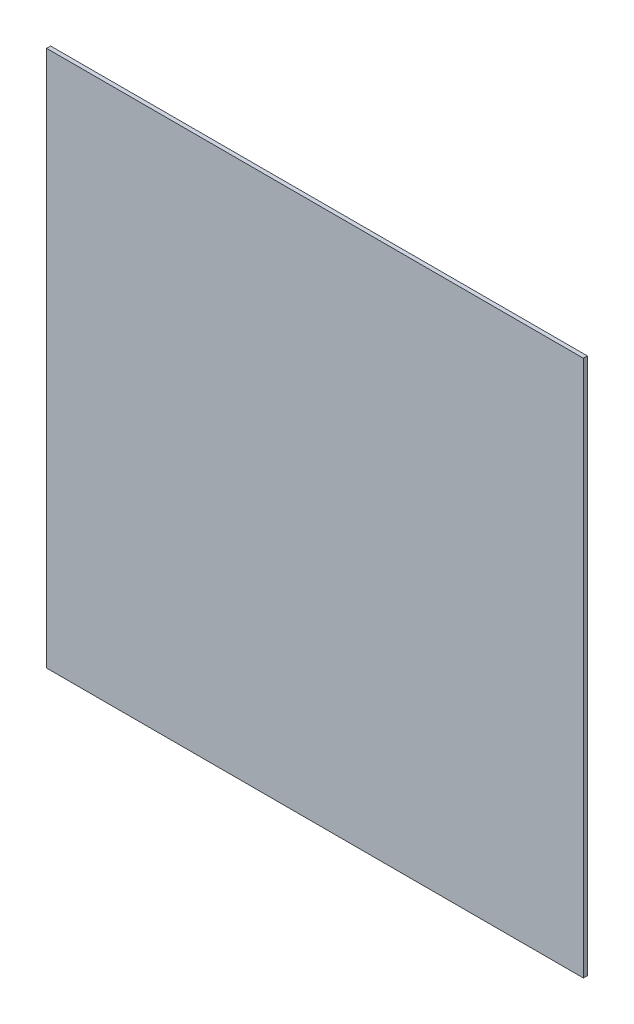
ISO-10303-21;
HEADER;
FILE_DESCRIPTION(('STEP AP214'),'2;1');
FILE_NAME('part.step','',(''),(''),'','','');
FILE_SCHEMA(('AUTOMOTIVE_DESIGN { 1 0 10303 214 1 1 1 1 }'));
ENDSEC;
DATA;
#1=APPLICATION_CONTEXT('core data for automotive mechanical design processes');
#2=APPLICATION_PROTOCOL_DEFINITION('international standard','automotive_design',2000,#1);
#3=PRODUCT_CONTEXT('',#1,'mechanical');
#4=PRODUCT('Part','Part','',(#3));
#5=PRODUCT_RELATED_PRODUCT_CATEGORY('part','',(#4));
#6=PRODUCT_DEFINITION_FORMATION('','',#4);
#7=PRODUCT_DEFINITION_CONTEXT('part definition',#1,'design');
#8=PRODUCT_DEFINITION('design','',#6,#7);
#9=PRODUCT_DEFINITION_SHAPE('','',#8);
#10=(LENGTH_UNIT() NAMED_UNIT(*) SI_UNIT(.MILLI.,.METRE.));
#11=(NAMED_UNIT(*) PLANE_ANGLE_UNIT() SI_UNIT($,.RADIAN.));
#12=(NAMED_UNIT(*) SI_UNIT($,.STERADIAN.) SOLID_ANGLE_UNIT());
#13=UNCERTAINTY_MEASURE_WITH_UNIT(LENGTH_MEASURE(1.E-05),#10,'distance_accuracy_value','');
#14=(GEOMETRIC_REPRESENTATION_CONTEXT(3) GLOBAL_UNCERTAINTY_ASSIGNED_CONTEXT((#13)) GLOBAL_UNIT_ASSIGNED_CONTEXT((#10,
#11,#12)) REPRESENTATION_CONTEXT('',''));
#15=CARTESIAN_POINT('',(0.,0.,0.));
#16=DIRECTION('',(0.,0.,1.));
#17=DIRECTION('',(1.,0.,0.));
#18=AXIS2_PLACEMENT_3D('',#15,#16,#17);
#19=CARTESIAN_POINT('',(0.,0.,-15.));
#20=DIRECTION('',(-1.,0.,0.));
#21=DIRECTION('',(0.,-1.,0.));
#22=AXIS2_PLACEMENT_3D('',#19,#20,#21);
#23=PLANE('',#22);
#24=DIRECTION('',(0.,-1.,0.));
#25=VECTOR('',#24,1.);
#26=CARTESIAN_POINT('',(0.,0.,0.));
#27=LINE('',#26,#25);
#28=CARTESIAN_POINT('',(0.,0.,0.));
#29=VERTEX_POINT('',#28);
#30=CARTESIAN_POINT('',(2.44929359829471E-13,-2000.,0.));
#31=VERTEX_POINT('',#30);
#32=EDGE_CURVE('E100',#29,#31,#27,.T.);
#33=ORIENTED_EDGE('',*,*,#32,.F.);
#34=DIRECTION('',(0.,0.,1.));
#35=VECTOR('',#34,1.);
#36=CARTESIAN_POINT('',(0.,0.,-15.));
#37=LINE('',#36,#35);
#38=CARTESIAN_POINT('',(0.,0.,-15.));
#39=VERTEX_POINT('',#38);
#40=EDGE_CURVE('E11',#39,#29,#37,.T.);
#41=ORIENTED_EDGE('',*,*,#40,.F.);
#42=DIRECTION('',(0.,-1.,0.));
#43=VECTOR('',#42,1.);
#44=CARTESIAN_POINT('',(0.,0.,-15.));
#45=LINE('',#44,#43);
#46=CARTESIAN_POINT('',(2.44929359829471E-13,-2000.,-15.));
#47=VERTEX_POINT('',#46);
#48=EDGE_CURVE('E94',#39,#47,#45,.T.);
#49=ORIENTED_EDGE('',*,*,#48,.T.);
#50=DIRECTION('',(0.,0.,1.));
#51=VECTOR('',#50,1.);
#52=CARTESIAN_POINT('',(2.44929359829471E-13,-2000.,-15.));
#53=LINE('',#52,#51);
#54=EDGE_CURVE('E39',#47,#31,#53,.T.);
#55=ORIENTED_EDGE('',*,*,#54,.T.);
#56=EDGE_LOOP('',(#33,#41,#49,#55));
#57=FACE_BOUND('',#56,.T.);
#58=ADVANCED_FACE('F36',(#57),#23,.T.);
#59=CARTESIAN_POINT('',(0.,0.,-15.));
#60=DIRECTION('',(0.,1.,0.));
#61=DIRECTION('',(0.,0.,1.));
#62=AXIS2_PLACEMENT_3D('',#59,#60,#61);
#63=PLANE('',#62);
#64=DIRECTION('',(-1.,0.,0.));
#65=VECTOR('',#64,1.);
#66=CARTESIAN_POINT('',(0.,0.,0.));
#67=LINE('',#66,#65);
#68=CARTESIAN_POINT('',(2000.,0.,0.));
#69=VERTEX_POINT('',#68);
#70=EDGE_CURVE('E96',#69,#29,#67,.T.);
#71=ORIENTED_EDGE('',*,*,#70,.F.);
#72=DIRECTION('',(0.,0.,1.));
#73=VECTOR('',#72,1.);
#74=CARTESIAN_POINT('',(2000.,0.,-15.));
#75=LINE('',#74,#73);
#76=CARTESIAN_POINT('',(2000.,0.,-15.));
#77=VERTEX_POINT('',#76);
#78=EDGE_CURVE('E45',#77,#69,#75,.T.);
#79=ORIENTED_EDGE('',*,*,#78,.F.);
#80=DIRECTION('',(-1.,0.,0.));
#81=VECTOR('',#80,1.);
#82=CARTESIAN_POINT('',(0.,0.,-15.));
#83=LINE('',#82,#81);
#84=EDGE_CURVE('E91',#77,#39,#83,.T.);
#85=ORIENTED_EDGE('',*,*,#84,.T.);
#86=ORIENTED_EDGE('',*,*,#40,.T.);
#87=EDGE_LOOP('',(#71,#79,#85,#86));
#88=FACE_BOUND('',#87,.T.);
#89=ADVANCED_FACE('F110',(#88),#63,.T.);
#90=CARTESIAN_POINT('',(2000.,0.,-15.));
#91=DIRECTION('',(1.,0.,0.));
#92=DIRECTION('',(0.,1.,0.));
#93=AXIS2_PLACEMENT_3D('',#90,#91,#92);
#94=PLANE('',#93);
#95=DIRECTION('',(0.,1.,0.));
#96=VECTOR('',#95,1.);
#97=CARTESIAN_POINT('',(2000.,0.,0.));
#98=LINE('',#97,#96);
#99=CARTESIAN_POINT('',(2000.,-2000.,0.));
#100=VERTEX_POINT('',#99);
#101=EDGE_CURVE('E86',#100,#69,#98,.T.);
#102=ORIENTED_EDGE('',*,*,#101,.F.);
#103=DIRECTION('',(0.,0.,1.));
#104=VECTOR('',#103,1.);
#105=CARTESIAN_POINT('',(2000.,-2000.,-15.));
#106=LINE('',#105,#104);
#107=CARTESIAN_POINT('',(2000.,-2000.,-15.));
#108=VERTEX_POINT('',#107);
#109=EDGE_CURVE('E81',#108,#100,#106,.T.);
#110=ORIENTED_EDGE('',*,*,#109,.F.);
#111=DIRECTION('',(0.,1.,0.));
#112=VECTOR('',#111,1.);
#113=CARTESIAN_POINT('',(2000.,0.,-15.));
#114=LINE('',#113,#112);
#115=EDGE_CURVE('E84',#108,#77,#114,.T.);
#116=ORIENTED_EDGE('',*,*,#115,.T.);
#117=ORIENTED_EDGE('',*,*,#78,.T.);
#118=EDGE_LOOP('',(#102,#110,#116,#117));
#119=FACE_BOUND('',#118,.T.);
#120=ADVANCED_FACE('F83',(#119),#94,.T.);
#121=CARTESIAN_POINT('',(2.44929359829471E-13,-2000.,-15.));
#122=DIRECTION('',(0.,-1.,0.));
#123=DIRECTION('',(0.,0.,-1.));
#124=AXIS2_PLACEMENT_3D('',#121,#122,#123);
#125=PLANE('',#124);
#126=DIRECTION('',(1.,0.,0.));
#127=VECTOR('',#126,1.);
#128=CARTESIAN_POINT('',(2.44929359829471E-13,-2000.,0.));
#129=LINE('',#128,#127);
#130=EDGE_CURVE('E103',#31,#100,#129,.T.);
#131=ORIENTED_EDGE('',*,*,#130,.F.);
#132=ORIENTED_EDGE('',*,*,#54,.F.);
#133=DIRECTION('',(1.,0.,0.));
#134=VECTOR('',#133,1.);
#135=CARTESIAN_POINT('',(2.44929359829471E-13,-2000.,-15.));
#136=LINE('',#135,#134);
#137=EDGE_CURVE('E90',#47,#108,#136,.T.);
#138=ORIENTED_EDGE('',*,*,#137,.T.);
#139=ORIENTED_EDGE('',*,*,#109,.T.);
#140=EDGE_LOOP('',(#131,#132,#138,#139));
#141=FACE_BOUND('',#140,.T.);
#142=ADVANCED_FACE('F93',(#141),#125,.T.);
#143=CARTESIAN_POINT('',(0.,0.,-15.));
#144=DIRECTION('',(0.,0.,1.));
#145=DIRECTION('',(1.,0.,0.));
#146=AXIS2_PLACEMENT_3D('',#143,#144,#145);
#147=PLANE('',#146);
#148=ORIENTED_EDGE('',*,*,#48,.F.);
#149=ORIENTED_EDGE('',*,*,#84,.F.);
#150=ORIENTED_EDGE('',*,*,#115,.F.);
#151=ORIENTED_EDGE('',*,*,#137,.F.);
#152=EDGE_LOOP('',(#148,#149,#150,#151));
#153=FACE_BOUND('',#152,.T.);
#154=ADVANCED_FACE('F89',(#153),#147,.F.);
#155=CARTESIAN_POINT('',(0.,0.,0.));
#156=DIRECTION('',(0.,0.,1.));
#157=DIRECTION('',(1.,0.,0.));
#158=AXIS2_PLACEMENT_3D('',#155,#156,#157);
#159=PLANE('',#158);
#160=ORIENTED_EDGE('',*,*,#32,.T.);
#161=ORIENTED_EDGE('',*,*,#130,.T.);
#162=ORIENTED_EDGE('',*,*,#101,.T.);
#163=ORIENTED_EDGE('',*,*,#70,.T.);
#164=EDGE_LOOP('',(#160,#161,#162,#163));
#165=FACE_BOUND('',#164,.T.);
#166=ADVANCED_FACE('F109',(#165),#159,.T.);
#167=CLOSED_SHELL('',(#58,#89,#120,#142,#154,#166));
#168=MANIFOLD_SOLID_BREP('B2',#167);
#169=ADVANCED_BREP_SHAPE_REPRESENTATION('',(#18,#168),#14);
#170=SHAPE_DEFINITION_REPRESENTATION(#9,#169);
ENDSEC;
END-ISO-10303-21;
